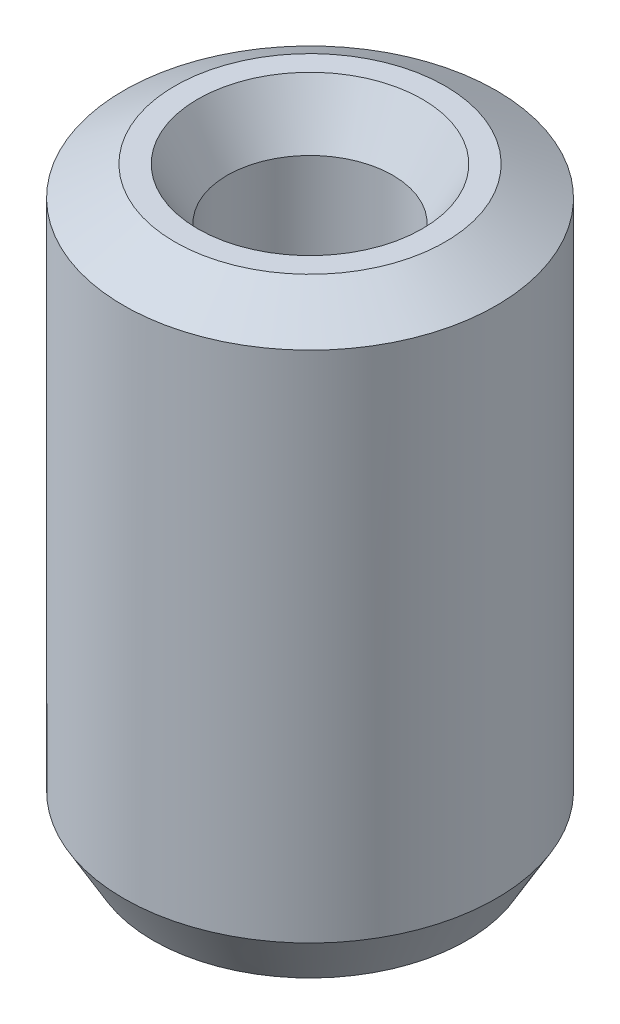
ISO-10303-21;
HEADER;
FILE_DESCRIPTION(('STEP AP214'),'2;1');
FILE_NAME('part.step','',(''),(''),'','','');
FILE_SCHEMA(('AUTOMOTIVE_DESIGN { 1 0 10303 214 1 1 1 1 }'));
ENDSEC;
DATA;
#1=APPLICATION_CONTEXT('core data for automotive mechanical design processes');
#2=APPLICATION_PROTOCOL_DEFINITION('international standard','automotive_design',2000,#1);
#3=PRODUCT_CONTEXT('',#1,'mechanical');
#4=PRODUCT('Part','Part','',(#3));
#5=PRODUCT_RELATED_PRODUCT_CATEGORY('part','',(#4));
#6=PRODUCT_DEFINITION_FORMATION('','',#4);
#7=PRODUCT_DEFINITION_CONTEXT('part definition',#1,'design');
#8=PRODUCT_DEFINITION('design','',#6,#7);
#9=PRODUCT_DEFINITION_SHAPE('','',#8);
#10=(LENGTH_UNIT() NAMED_UNIT(*) SI_UNIT(.MILLI.,.METRE.));
#11=(NAMED_UNIT(*) PLANE_ANGLE_UNIT() SI_UNIT($,.RADIAN.));
#12=(NAMED_UNIT(*) SI_UNIT($,.STERADIAN.) SOLID_ANGLE_UNIT());
#13=UNCERTAINTY_MEASURE_WITH_UNIT(LENGTH_MEASURE(1.E-05),#10,'distance_accuracy_value','');
#14=(GEOMETRIC_REPRESENTATION_CONTEXT(3) GLOBAL_UNCERTAINTY_ASSIGNED_CONTEXT((#13)) GLOBAL_UNIT_ASSIGNED_CONTEXT((#10,
#11,#12)) REPRESENTATION_CONTEXT('',''));
#15=CARTESIAN_POINT('',(0.,0.,0.));
#16=DIRECTION('',(0.,0.,1.));
#17=DIRECTION('',(1.,0.,0.));
#18=AXIS2_PLACEMENT_3D('',#15,#16,#17);
#19=CARTESIAN_POINT('',(0.,23.9167360112695,0.));
#20=DIRECTION('',(0.,-1.,0.));
#21=DIRECTION('',(0.,0.,-1.));
#22=AXIS2_PLACEMENT_3D('',#19,#20,#21);
#23=CYLINDRICAL_SURFACE('',#22,7.5);
#24=CARTESIAN_POINT('',(0.,2.05929540976839,0.));
#25=DIRECTION('',(0.,1.,0.));
#26=DIRECTION('',(0.,0.,1.));
#27=AXIS2_PLACEMENT_3D('',#24,#25,#26);
#28=CIRCLE('',#27,7.5);
#29=CARTESIAN_POINT('',(0.,2.05929540976839,-7.5));
#30=VERTEX_POINT('',#29);
#31=EDGE_CURVE('E10',#30,#30,#28,.T.);
#32=CARTESIAN_POINT('',(0.,22.7278012520987,0.));
#33=DIRECTION('',(0.,1.,0.));
#34=DIRECTION('',(0.,0.,1.));
#35=AXIS2_PLACEMENT_3D('',#32,#33,#34);
#36=CIRCLE('',#35,7.5);
#37=CARTESIAN_POINT('',(0.,22.7278012520987,-7.5));
#38=VERTEX_POINT('',#37);
#39=EDGE_CURVE('E50',#38,#38,#36,.F.);
#40=CARTESIAN_POINT('',(0.,2.05929540976839,-7.5));
#41=CARTESIAN_POINT('',(0.,2.274592345626,-7.5));
#42=CARTESIAN_POINT('',(0.,2.4898892814836,-7.5));
#43=CARTESIAN_POINT('',(0.,2.92048315319882,-7.5));
#44=CARTESIAN_POINT('',(0.,3.13578008905643,-7.5));
#45=CARTESIAN_POINT('',(0.,3.56637396077164,-7.5));
#46=CARTESIAN_POINT('',(0.,3.78167089662925,-7.5));
#47=CARTESIAN_POINT('',(0.,4.21226476834447,-7.5));
#48=CARTESIAN_POINT('',(0.,4.42756170420207,-7.5));
#49=CARTESIAN_POINT('',(0.,4.85815557591729,-7.5));
#50=CARTESIAN_POINT('',(0.,5.0734525117749,-7.5));
#51=CARTESIAN_POINT('',(0.,5.50404638349011,-7.5));
#52=CARTESIAN_POINT('',(0.,5.71934331934772,-7.5));
#53=CARTESIAN_POINT('',(0.,6.14993719106294,-7.5));
#54=CARTESIAN_POINT('',(0.,6.36523412692055,-7.5));
#55=CARTESIAN_POINT('',(0.,6.79582799863576,-7.5));
#56=CARTESIAN_POINT('',(0.,7.01112493449337,-7.5));
#57=CARTESIAN_POINT('',(0.,7.44171880620858,-7.5));
#58=CARTESIAN_POINT('',(0.,7.65701574206619,-7.5));
#59=CARTESIAN_POINT('',(0.,8.08760961378141,-7.5));
#60=CARTESIAN_POINT('',(0.,8.30290654963902,-7.5));
#61=CARTESIAN_POINT('',(0.,8.73350042135423,-7.5));
#62=CARTESIAN_POINT('',(0.,8.94879735721184,-7.5));
#63=CARTESIAN_POINT('',(0.,9.37939122892706,-7.5));
#64=CARTESIAN_POINT('',(0.,9.59468816478466,-7.5));
#65=CARTESIAN_POINT('',(0.,10.0252820364999,-7.5));
#66=CARTESIAN_POINT('',(0.,10.2405789723575,-7.5));
#67=CARTESIAN_POINT('',(0.,10.6711728440727,-7.5));
#68=CARTESIAN_POINT('',(0.,10.8864697799303,-7.5));
#69=CARTESIAN_POINT('',(0.,11.3170636516455,-7.5));
#70=CARTESIAN_POINT('',(0.,11.5323605875031,-7.5));
#71=CARTESIAN_POINT('',(0.,11.9629544592183,-7.5));
#72=CARTESIAN_POINT('',(0.,12.178251395076,-7.5));
#73=CARTESIAN_POINT('',(0.,12.6088452667912,-7.5));
#74=CARTESIAN_POINT('',(0.,12.8241422026488,-7.5));
#75=CARTESIAN_POINT('',(0.,13.254736074364,-7.5));
#76=CARTESIAN_POINT('',(0.,13.4700330102216,-7.5));
#77=CARTESIAN_POINT('',(0.,13.9006268819368,-7.5));
#78=CARTESIAN_POINT('',(0.,14.1159238177944,-7.5));
#79=CARTESIAN_POINT('',(0.,14.5465176895096,-7.5));
#80=CARTESIAN_POINT('',(0.,14.7618146253673,-7.5));
#81=CARTESIAN_POINT('',(0.,15.1924084970825,-7.5));
#82=CARTESIAN_POINT('',(0.,15.4077054329401,-7.5));
#83=CARTESIAN_POINT('',(0.,15.8382993046553,-7.5));
#84=CARTESIAN_POINT('',(0.,16.0535962405129,-7.5));
#85=CARTESIAN_POINT('',(0.,16.4841901122281,-7.5));
#86=CARTESIAN_POINT('',(0.,16.6994870480857,-7.5));
#87=CARTESIAN_POINT('',(0.,17.1300809198009,-7.5));
#88=CARTESIAN_POINT('',(0.,17.3453778556585,-7.5));
#89=CARTESIAN_POINT('',(0.,17.7759717273738,-7.5));
#90=CARTESIAN_POINT('',(0.,17.9912686632314,-7.5));
#91=CARTESIAN_POINT('',(0.,18.4218625349466,-7.5));
#92=CARTESIAN_POINT('',(0.,18.6371594708042,-7.5));
#93=CARTESIAN_POINT('',(0.,19.0677533425194,-7.5));
#94=CARTESIAN_POINT('',(0.,19.283050278377,-7.5));
#95=CARTESIAN_POINT('',(0.,19.7136441500922,-7.5));
#96=CARTESIAN_POINT('',(0.,19.9289410859498,-7.5));
#97=CARTESIAN_POINT('',(0.,20.3595349576651,-7.5));
#98=CARTESIAN_POINT('',(0.,20.5748318935227,-7.5));
#99=CARTESIAN_POINT('',(0.,21.0054257652379,-7.5));
#100=CARTESIAN_POINT('',(0.,21.2207227010955,-7.5));
#101=CARTESIAN_POINT('',(0.,21.6513165728107,-7.5));
#102=CARTESIAN_POINT('',(0.,21.8666135086683,-7.5));
#103=CARTESIAN_POINT('',(0.,22.2972073803835,-7.5));
#104=CARTESIAN_POINT('',(0.,22.5125043162411,-7.5));
#105=CARTESIAN_POINT('',(0.,22.7278012520987,-7.5));
#106=B_SPLINE_CURVE_WITH_KNOTS('',3,(#40,#41,#42,#43,#44,#45,#46,#47,#48,#49,#50,#51,#52,#53,
#54,#55,#56,#57,#58,#59,#60,#61,#62,#63,#64,#65,#66,#67,#68,#69,#70,#71,#72,#73,#74,#75,#76,#77,
#78,#79,#80,#81,#82,#83,#84,#85,#86,#87,#88,#89,#90,#91,#92,#93,#94,#95,#96,#97,#98,#99,#100,
#101,#102,#103,#104,#105),.UNSPECIFIED.,.F.,.F.,(4,2,2,2,2,2,2,2,2,2,2,2,2,2,2,2,2,2,2,2,2,2,2,
2,2,2,2,2,2,2,2,2,4),(0.,0.645890807572824,1.29178161514565,1.93767242271847,2.58356323029129,
3.22945403786412,3.87534484543694,4.52123565300977,5.16712646058259,5.81301726815541,
6.45890807572823,7.10479888330106,7.75068969087388,8.3965804984467,9.04247130601953,
9.68836211359235,10.3342529211652,10.980143728738,11.6260345363108,12.2719253438836,
12.9178161514565,13.5637069590293,14.2095977666021,14.8554885741749,15.5013793817478,
16.1472701893206,16.7931609968934,17.4390518044662,18.0849426120391,18.7308334196119,
19.3767242271847,20.0226150347575,20.6685058423304),.UNSPECIFIED.);
#107=EDGE_CURVE('BSEAM39',#30,#38,#106,.T.);
#108=ORIENTED_EDGE('',*,*,#31,.T.);
#109=ORIENTED_EDGE('',*,*,#39,.T.);
#110=ORIENTED_EDGE('',*,*,#107,.T.);
#111=ORIENTED_EDGE('',*,*,#107,.F.);
#112=EDGE_LOOP('',(#108,#110,#109,#111));
#113=FACE_BOUND('',#112,.T.);
#114=ADVANCED_FACE('F39',(#113),#23,.T.);
#115=CARTESIAN_POINT('',(0.,23.9167360112695,0.));
#116=DIRECTION('',(0.,1.,0.));
#117=DIRECTION('',(0.,0.,1.));
#118=AXIS2_PLACEMENT_3D('',#115,#116,#117);
#119=PLANE('',#118);
#120=CARTESIAN_POINT('',(0.,23.9167360112695,0.));
#121=DIRECTION('',(0.,1.,0.));
#122=DIRECTION('',(0.,0.,1.));
#123=AXIS2_PLACEMENT_3D('',#120,#121,#122);
#124=CIRCLE('',#123,4.52099982928832);
#125=CARTESIAN_POINT('',(0.,23.9167360112695,4.52099982928832));
#126=VERTEX_POINT('',#125);
#127=EDGE_CURVE('E58',#126,#126,#124,.F.);
#128=ORIENTED_EDGE('',*,*,#127,.T.);
#129=EDGE_LOOP('',(#128));
#130=FACE_BOUND('',#129,.T.);
#131=CARTESIAN_POINT('',(0.,23.9167360112695,0.));
#132=DIRECTION('',(0.,1.,0.));
#133=DIRECTION('',(0.,0.,1.));
#134=AXIS2_PLACEMENT_3D('',#131,#132,#133);
#135=CIRCLE('',#134,5.44070459023165);
#136=CARTESIAN_POINT('',(0.,23.9167360112695,5.44070459023165));
#137=VERTEX_POINT('',#136);
#138=EDGE_CURVE('E61',#137,#137,#135,.T.);
#139=ORIENTED_EDGE('',*,*,#138,.T.);
#140=EDGE_LOOP('',(#139));
#141=FACE_BOUND('',#140,.T.);
#142=ADVANCED_FACE('F88',(#130,#141),#119,.T.);
#143=CARTESIAN_POINT('',(0.,0.,0.));
#144=DIRECTION('',(0.,1.,0.));
#145=DIRECTION('',(0.,0.,1.));
#146=AXIS2_PLACEMENT_3D('',#143,#144,#145);
#147=PLANE('',#146);
#148=CARTESIAN_POINT('',(0.,0.,0.));
#149=DIRECTION('',(0.,1.,0.));
#150=DIRECTION('',(0.,0.,1.));
#151=AXIS2_PLACEMENT_3D('',#148,#149,#150);
#152=CIRCLE('',#151,5.39136047988591);
#153=CARTESIAN_POINT('',(0.,0.,5.39136047988591));
#154=VERTEX_POINT('',#153);
#155=EDGE_CURVE('E51',#154,#154,#152,.T.);
#156=ORIENTED_EDGE('',*,*,#155,.T.);
#157=EDGE_LOOP('',(#156));
#158=FACE_BOUND('',#157,.T.);
#159=CARTESIAN_POINT('',(0.,0.,0.));
#160=DIRECTION('',(0.,1.,0.));
#161=DIRECTION('',(0.,0.,1.));
#162=AXIS2_PLACEMENT_3D('',#159,#160,#161);
#163=CIRCLE('',#162,6.31106524082925);
#164=CARTESIAN_POINT('',(0.,0.,6.31106524082925));
#165=VERTEX_POINT('',#164);
#166=EDGE_CURVE('E54',#165,#165,#163,.F.);
#167=ORIENTED_EDGE('',*,*,#166,.T.);
#168=EDGE_LOOP('',(#167));
#169=FACE_BOUND('',#168,.T.);
#170=ADVANCED_FACE('F83',(#158,#169),#147,.F.);
#171=CARTESIAN_POINT('',(0.,23.9167360112695,0.));
#172=DIRECTION('',(0.,-1.,0.));
#173=DIRECTION('',(0.,0.,-1.));
#174=AXIS2_PLACEMENT_3D('',#171,#172,#173);
#175=CYLINDRICAL_SURFACE('',#174,3.33206507011757);
#176=CARTESIAN_POINT('',(0.,21.8574406015011,0.));
#177=DIRECTION('',(0.,1.,0.));
#178=DIRECTION('',(0.,0.,1.));
#179=AXIS2_PLACEMENT_3D('',#176,#177,#178);
#180=CIRCLE('',#179,3.33206507011757);
#181=CARTESIAN_POINT('',(0.,21.8574406015011,-3.33206507011757));
#182=VERTEX_POINT('',#181);
#183=EDGE_CURVE('E67',#182,#182,#180,.T.);
#184=CARTESIAN_POINT('',(0.,1.18893475917072,0.));
#185=DIRECTION('',(0.,1.,0.));
#186=DIRECTION('',(0.,0.,1.));
#187=AXIS2_PLACEMENT_3D('',#184,#185,#186);
#188=CIRCLE('',#187,3.33206507011757);
#189=CARTESIAN_POINT('',(0.,1.18893475917072,-3.33206507011757));
#190=VERTEX_POINT('',#189);
#191=EDGE_CURVE('E69',#190,#190,#188,.F.);
#192=CARTESIAN_POINT('',(0.,21.8574406015011,-3.33206507011757));
#193=CARTESIAN_POINT('',(0.,21.6421436656435,-3.33206507011757));
#194=CARTESIAN_POINT('',(0.,21.4268467297859,-3.33206507011757));
#195=CARTESIAN_POINT('',(0.,20.9962528580706,-3.33206507011757));
#196=CARTESIAN_POINT('',(0.,20.780955922213,-3.33206507011757));
#197=CARTESIAN_POINT('',(0.,20.3503620504978,-3.33206507011757));
#198=CARTESIAN_POINT('',(0.,20.1350651146402,-3.33206507011757));
#199=CARTESIAN_POINT('',(0.,19.704471242925,-3.33206507011757));
#200=CARTESIAN_POINT('',(0.,19.4891743070674,-3.33206507011757));
#201=CARTESIAN_POINT('',(0.,19.0585804353522,-3.33206507011757));
#202=CARTESIAN_POINT('',(0.,18.8432834994946,-3.33206507011757));
#203=CARTESIAN_POINT('',(0.,18.4126896277793,-3.33206507011757));
#204=CARTESIAN_POINT('',(0.,18.1973926919217,-3.33206507011757));
#205=CARTESIAN_POINT('',(0.,17.7667988202065,-3.33206507011757));
#206=CARTESIAN_POINT('',(0.,17.5515018843489,-3.33206507011757));
#207=CARTESIAN_POINT('',(0.,17.1209080126337,-3.33206507011757));
#208=CARTESIAN_POINT('',(0.,16.9056110767761,-3.33206507011757));
#209=CARTESIAN_POINT('',(0.,16.4750172050609,-3.33206507011757));
#210=CARTESIAN_POINT('',(0.,16.2597202692033,-3.33206507011757));
#211=CARTESIAN_POINT('',(0.,15.8291263974881,-3.33206507011757));
#212=CARTESIAN_POINT('',(0.,15.6138294616304,-3.33206507011757));
#213=CARTESIAN_POINT('',(0.,15.1832355899152,-3.33206507011757));
#214=CARTESIAN_POINT('',(0.,14.9679386540576,-3.33206507011757));
#215=CARTESIAN_POINT('',(0.,14.5373447823424,-3.33206507011757));
#216=CARTESIAN_POINT('',(0.,14.3220478464848,-3.33206507011757));
#217=CARTESIAN_POINT('',(0.,13.8914539747696,-3.33206507011757));
#218=CARTESIAN_POINT('',(0.,13.676157038912,-3.33206507011757));
#219=CARTESIAN_POINT('',(0.,13.2455631671968,-3.33206507011757));
#220=CARTESIAN_POINT('',(0.,13.0302662313392,-3.33206507011757));
#221=CARTESIAN_POINT('',(0.,12.5996723596239,-3.33206507011757));
#222=CARTESIAN_POINT('',(0.,12.3843754237663,-3.33206507011757));
#223=CARTESIAN_POINT('',(0.,11.9537815520511,-3.33206507011757));
#224=CARTESIAN_POINT('',(0.,11.7384846161935,-3.33206507011757));
#225=CARTESIAN_POINT('',(0.,11.3078907444783,-3.33206507011757));
#226=CARTESIAN_POINT('',(0.,11.0925938086207,-3.33206507011757));
#227=CARTESIAN_POINT('',(0.,10.6619999369055,-3.33206507011757));
#228=CARTESIAN_POINT('',(0.,10.4467030010479,-3.33206507011757));
#229=CARTESIAN_POINT('',(0.,10.0161091293326,-3.33206507011757));
#230=CARTESIAN_POINT('',(0.,9.80081219347504,-3.33206507011757));
#231=CARTESIAN_POINT('',(0.,9.37021832175982,-3.33206507011757));
#232=CARTESIAN_POINT('',(0.,9.15492138590221,-3.33206507011757));
#233=CARTESIAN_POINT('',(0.,8.724327514187,-3.33206507011757));
#234=CARTESIAN_POINT('',(0.,8.50903057832939,-3.33206507011757));
#235=CARTESIAN_POINT('',(0.,8.07843670661417,-3.33206507011757));
#236=CARTESIAN_POINT('',(0.,7.86313977075656,-3.33206507011757));
#237=CARTESIAN_POINT('',(0.,7.43254589904135,-3.33206507011757));
#238=CARTESIAN_POINT('',(0.,7.21724896318374,-3.33206507011757));
#239=CARTESIAN_POINT('',(0.,6.78665509146853,-3.33206507011757));
#240=CARTESIAN_POINT('',(0.,6.57135815561092,-3.33206507011757));
#241=CARTESIAN_POINT('',(0.,6.14076428389571,-3.33206507011757));
#242=CARTESIAN_POINT('',(0.,5.9254673480381,-3.33206507011757));
#243=CARTESIAN_POINT('',(0.,5.49487347632288,-3.33206507011757));
#244=CARTESIAN_POINT('',(0.,5.27957654046527,-3.33206507011757));
#245=CARTESIAN_POINT('',(0.,4.84898266875006,-3.33206507011757));
#246=CARTESIAN_POINT('',(0.,4.63368573289245,-3.33206507011757));
#247=CARTESIAN_POINT('',(0.,4.20309186117723,-3.33206507011757));
#248=CARTESIAN_POINT('',(0.,3.98779492531962,-3.33206507011757));
#249=CARTESIAN_POINT('',(0.,3.55720105360441,-3.33206507011757));
#250=CARTESIAN_POINT('',(0.,3.3419041177468,-3.33206507011757));
#251=CARTESIAN_POINT('',(0.,2.91131024603158,-3.33206507011757));
#252=CARTESIAN_POINT('',(0.,2.69601331017398,-3.33206507011757));
#253=CARTESIAN_POINT('',(0.,2.26541943845876,-3.33206507011757));
#254=CARTESIAN_POINT('',(0.,2.05012250260115,-3.33206507011757));
#255=CARTESIAN_POINT('',(0.,1.61952863088594,-3.33206507011757));
#256=CARTESIAN_POINT('',(0.,1.40423169502833,-3.33206507011757));
#257=CARTESIAN_POINT('',(0.,1.18893475917072,-3.33206507011757));
#258=B_SPLINE_CURVE_WITH_KNOTS('',3,(#192,#193,#194,#195,#196,#197,#198,#199,#200,#201,#202,
#203,#204,#205,#206,#207,#208,#209,#210,#211,#212,#213,#214,#215,#216,#217,#218,#219,#220,#221,
#222,#223,#224,#225,#226,#227,#228,#229,#230,#231,#232,#233,#234,#235,#236,#237,#238,#239,#240,
#241,#242,#243,#244,#245,#246,#247,#248,#249,#250,#251,#252,#253,#254,#255,#256,#257),
.UNSPECIFIED.,.F.,.F.,(4,2,2,2,2,2,2,2,2,2,2,2,2,2,2,2,2,2,2,2,2,2,2,2,2,2,2,2,2,2,2,2,4),(0.,
0.645890807572821,1.29178161514564,1.93767242271847,2.58356323029129,3.22945403786412,
3.87534484543694,4.52123565300976,5.16712646058259,5.81301726815541,6.45890807572823,
7.10479888330106,7.75068969087388,8.3965804984467,9.04247130601953,9.68836211359235,
10.3342529211652,10.980143728738,11.6260345363108,12.2719253438836,12.9178161514565,
13.5637069590293,14.2095977666021,14.8554885741749,15.5013793817478,16.1472701893206,
16.7931609968934,17.4390518044662,18.0849426120391,18.7308334196119,19.3767242271847,
20.0226150347575,20.6685058423304),.UNSPECIFIED.);
#259=EDGE_CURVE('BSEAM71',#182,#190,#258,.T.);
#260=ORIENTED_EDGE('',*,*,#183,.T.);
#261=ORIENTED_EDGE('',*,*,#191,.T.);
#262=ORIENTED_EDGE('',*,*,#259,.T.);
#263=ORIENTED_EDGE('',*,*,#259,.F.);
#264=EDGE_LOOP('',(#260,#262,#261,#263));
#265=FACE_BOUND('',#264,.T.);
#266=ADVANCED_FACE('F71',(#265),#175,.F.);
#267=CARTESIAN_POINT('',(0.,21.8574406015011,0.));
#268=DIRECTION('',(0.,1.,0.));
#269=DIRECTION('',(0.,0.,1.));
#270=AXIS2_PLACEMENT_3D('',#267,#268,#269);
#271=CONICAL_SURFACE('',#270,3.33206507011757,0.523598775598301);
#272=ORIENTED_EDGE('',*,*,#127,.F.);
#273=EDGE_LOOP('',(#272));
#274=FACE_BOUND('',#273,.T.);
#275=ORIENTED_EDGE('',*,*,#183,.F.);
#276=EDGE_LOOP('',(#275));
#277=FACE_BOUND('',#276,.T.);
#278=ADVANCED_FACE('F77',(#274,#277),#271,.F.);
#279=CARTESIAN_POINT('',(0.,0.,0.));
#280=DIRECTION('',(0.,-1.,0.));
#281=DIRECTION('',(0.,0.,-1.));
#282=AXIS2_PLACEMENT_3D('',#279,#280,#281);
#283=CONICAL_SURFACE('',#282,5.39136047988591,1.04719755119659);
#284=ORIENTED_EDGE('',*,*,#191,.F.);
#285=EDGE_LOOP('',(#284));
#286=FACE_BOUND('',#285,.T.);
#287=ORIENTED_EDGE('',*,*,#155,.F.);
#288=EDGE_LOOP('',(#287));
#289=FACE_BOUND('',#288,.T.);
#290=ADVANCED_FACE('F73',(#286,#289),#283,.F.);
#291=CARTESIAN_POINT('',(0.,2.05929540976839,0.));
#292=DIRECTION('',(0.,1.,0.));
#293=DIRECTION('',(0.,0.,1.));
#294=AXIS2_PLACEMENT_3D('',#291,#292,#293);
#295=CONICAL_SURFACE('',#294,7.5,0.523598775598302);
#296=ORIENTED_EDGE('',*,*,#166,.F.);
#297=EDGE_LOOP('',(#296));
#298=FACE_BOUND('',#297,.T.);
#299=ORIENTED_EDGE('',*,*,#31,.F.);
#300=EDGE_LOOP('',(#299));
#301=FACE_BOUND('',#300,.T.);
#302=ADVANCED_FACE('F76',(#298,#301),#295,.T.);
#303=CARTESIAN_POINT('',(0.,23.9167360112695,0.));
#304=DIRECTION('',(0.,-1.,0.));
#305=DIRECTION('',(0.,0.,-1.));
#306=AXIS2_PLACEMENT_3D('',#303,#304,#305);
#307=CONICAL_SURFACE('',#306,5.44070459023165,1.04719755119659);
#308=ORIENTED_EDGE('',*,*,#39,.F.);
#309=EDGE_LOOP('',(#308));
#310=FACE_BOUND('',#309,.T.);
#311=ORIENTED_EDGE('',*,*,#138,.F.);
#312=EDGE_LOOP('',(#311));
#313=FACE_BOUND('',#312,.T.);
#314=ADVANCED_FACE('F45',(#310,#313),#307,.T.);
#315=CLOSED_SHELL('',(#114,#142,#170,#266,#278,#290,#302,#314));
#316=MANIFOLD_SOLID_BREP('B2',#315);
#317=ADVANCED_BREP_SHAPE_REPRESENTATION('',(#18,#316),#14);
#318=SHAPE_DEFINITION_REPRESENTATION(#9,#317);
ENDSEC;
END-ISO-10303-21;
